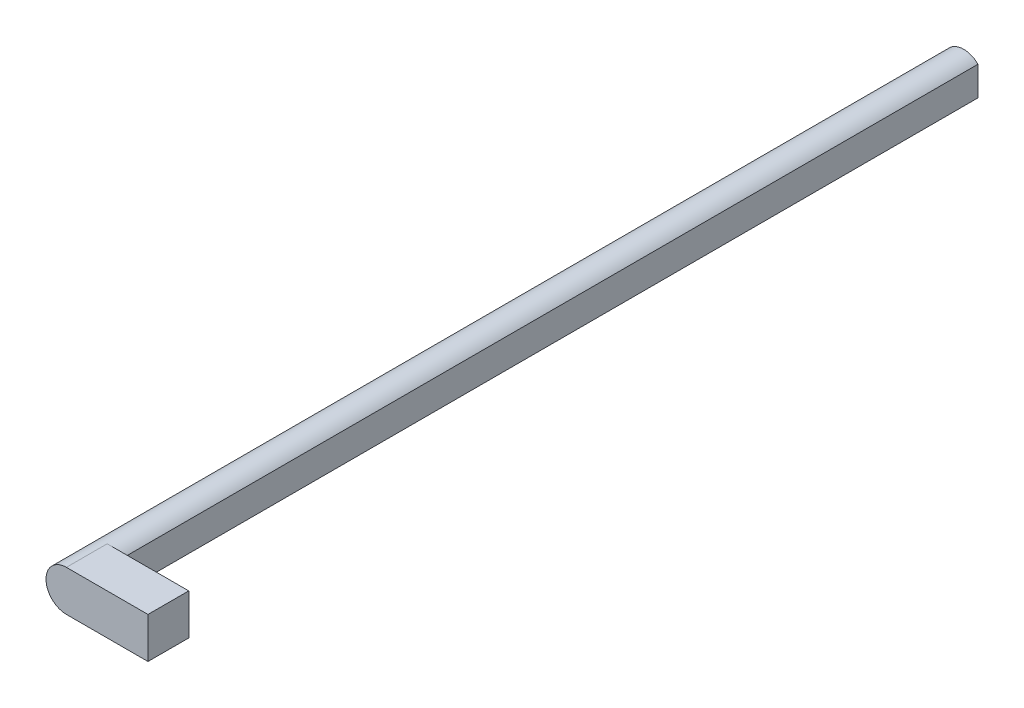
ISO-10303-21;
HEADER;
FILE_DESCRIPTION(('STEP AP214'),'2;1');
FILE_NAME('part.step','',(''),(''),'','','');
FILE_SCHEMA(('AUTOMOTIVE_DESIGN { 1 0 10303 214 1 1 1 1 }'));
ENDSEC;
DATA;
#1=APPLICATION_CONTEXT('core data for automotive mechanical design processes');
#2=APPLICATION_PROTOCOL_DEFINITION('international standard','automotive_design',2000,#1);
#3=PRODUCT_CONTEXT('',#1,'mechanical');
#4=PRODUCT('Part','Part','',(#3));
#5=PRODUCT_RELATED_PRODUCT_CATEGORY('part','',(#4));
#6=PRODUCT_DEFINITION_FORMATION('','',#4);
#7=PRODUCT_DEFINITION_CONTEXT('part definition',#1,'design');
#8=PRODUCT_DEFINITION('design','',#6,#7);
#9=PRODUCT_DEFINITION_SHAPE('','',#8);
#10=(LENGTH_UNIT() NAMED_UNIT(*) SI_UNIT(.MILLI.,.METRE.));
#11=(NAMED_UNIT(*) PLANE_ANGLE_UNIT() SI_UNIT($,.RADIAN.));
#12=(NAMED_UNIT(*) SI_UNIT($,.STERADIAN.) SOLID_ANGLE_UNIT());
#13=UNCERTAINTY_MEASURE_WITH_UNIT(LENGTH_MEASURE(1.E-05),#10,'distance_accuracy_value','');
#14=(GEOMETRIC_REPRESENTATION_CONTEXT(3) GLOBAL_UNCERTAINTY_ASSIGNED_CONTEXT((#13)) GLOBAL_UNIT_ASSIGNED_CONTEXT((#10,
#11,#12)) REPRESENTATION_CONTEXT('',''));
#15=CARTESIAN_POINT('',(0.,0.,0.));
#16=DIRECTION('',(0.,0.,1.));
#17=DIRECTION('',(1.,0.,0.));
#18=AXIS2_PLACEMENT_3D('',#15,#16,#17);
#19=CARTESIAN_POINT('',(3.5,0.,220.));
#20=DIRECTION('',(-1.,0.,0.));
#21=DIRECTION('',(0.,0.,1.));
#22=AXIS2_PLACEMENT_3D('',#19,#20,#21);
#23=PLANE('',#22);
#24=DIRECTION('',(0.,1.,0.));
#25=VECTOR('',#24,1.);
#26=CARTESIAN_POINT('',(3.5,0.,210.));
#27=LINE('',#26,#25);
#28=CARTESIAN_POINT('',(3.5,-3.57071421427143,210.));
#29=VERTEX_POINT('',#28);
#30=CARTESIAN_POINT('',(3.5,3.57071421427143,210.));
#31=VERTEX_POINT('',#30);
#32=EDGE_CURVE('E112',#29,#31,#27,.T.);
#33=ORIENTED_EDGE('',*,*,#32,.F.);
#34=DIRECTION('',(0.,0.,-1.));
#35=VECTOR('',#34,1.);
#36=CARTESIAN_POINT('',(3.5,-3.57071421427143,220.));
#37=LINE('',#36,#35);
#38=CARTESIAN_POINT('',(3.5,-3.57071421427143,0.));
#39=VERTEX_POINT('',#38);
#40=EDGE_CURVE('E57',#29,#39,#37,.T.);
#41=ORIENTED_EDGE('',*,*,#40,.T.);
#42=DIRECTION('',(0.,1.,0.));
#43=VECTOR('',#42,1.);
#44=CARTESIAN_POINT('',(3.5,0.,0.));
#45=LINE('',#44,#43);
#46=CARTESIAN_POINT('',(3.5,3.57071421427143,0.));
#47=VERTEX_POINT('',#46);
#48=EDGE_CURVE('E114',#39,#47,#45,.T.);
#49=ORIENTED_EDGE('',*,*,#48,.T.);
#50=DIRECTION('',(0.,0.,-1.));
#51=VECTOR('',#50,1.);
#52=CARTESIAN_POINT('',(3.5,3.57071421427143,220.));
#53=LINE('',#52,#51);
#54=EDGE_CURVE('E125',#31,#47,#53,.T.);
#55=ORIENTED_EDGE('',*,*,#54,.F.);
#56=EDGE_LOOP('',(#33,#41,#49,#55));
#57=FACE_BOUND('',#56,.T.);
#58=ADVANCED_FACE('F35',(#57),#23,.F.);
#59=CARTESIAN_POINT('',(0.,0.,220.));
#60=DIRECTION('',(0.,0.,-1.));
#61=DIRECTION('',(-1.,0.,0.));
#62=AXIS2_PLACEMENT_3D('',#59,#60,#61);
#63=CYLINDRICAL_SURFACE('',#62,5.);
#64=CARTESIAN_POINT('',(0.,0.,210.));
#65=DIRECTION('',(0.,0.,1.));
#66=DIRECTION('',(1.,0.,0.));
#67=AXIS2_PLACEMENT_3D('',#64,#65,#66);
#68=CIRCLE('',#67,5.);
#69=CARTESIAN_POINT('',(0.,5.,210.));
#70=VERTEX_POINT('',#69);
#71=EDGE_CURVE('E11',#31,#70,#68,.T.);
#72=ORIENTED_EDGE('',*,*,#71,.F.);
#73=ORIENTED_EDGE('',*,*,#54,.T.);
#74=CARTESIAN_POINT('',(0.,0.,0.));
#75=DIRECTION('',(0.,0.,1.));
#76=DIRECTION('',(1.,0.,0.));
#77=AXIS2_PLACEMENT_3D('',#74,#75,#76);
#78=CIRCLE('',#77,5.);
#79=EDGE_CURVE('E122',#47,#39,#78,.T.);
#80=ORIENTED_EDGE('',*,*,#79,.T.);
#81=ORIENTED_EDGE('',*,*,#40,.F.);
#82=CARTESIAN_POINT('',(0.,-5.,210.));
#83=VERTEX_POINT('',#82);
#84=EDGE_CURVE('E38',#83,#29,#68,.T.);
#85=ORIENTED_EDGE('',*,*,#84,.F.);
#86=DIRECTION('',(0.,0.,-1.));
#87=VECTOR('',#86,1.);
#88=CARTESIAN_POINT('',(0.,-5.,220.));
#89=LINE('',#88,#87);
#90=CARTESIAN_POINT('',(0.,-5.,220.));
#91=VERTEX_POINT('',#90);
#92=EDGE_CURVE('E108',#91,#83,#89,.T.);
#93=ORIENTED_EDGE('',*,*,#92,.F.);
#94=CARTESIAN_POINT('',(0.,0.,220.));
#95=DIRECTION('',(0.,0.,1.));
#96=DIRECTION('',(1.,0.,0.));
#97=AXIS2_PLACEMENT_3D('',#94,#95,#96);
#98=CIRCLE('',#97,5.);
#99=CARTESIAN_POINT('',(0.,5.,220.));
#100=VERTEX_POINT('',#99);
#101=EDGE_CURVE('E119',#100,#91,#98,.T.);
#102=ORIENTED_EDGE('',*,*,#101,.F.);
#103=DIRECTION('',(0.,0.,1.));
#104=VECTOR('',#103,1.);
#105=CARTESIAN_POINT('',(0.,5.,220.));
#106=LINE('',#105,#104);
#107=EDGE_CURVE('E193',#70,#100,#106,.T.);
#108=ORIENTED_EDGE('',*,*,#107,.F.);
#109=EDGE_LOOP('',(#72,#73,#80,#81,#85,#93,#102,#108));
#110=FACE_BOUND('',#109,.T.);
#111=ADVANCED_FACE('F131',(#110),#63,.T.);
#112=CARTESIAN_POINT('',(0.,0.,220.));
#113=DIRECTION('',(0.,0.,1.));
#114=DIRECTION('',(1.,0.,0.));
#115=AXIS2_PLACEMENT_3D('',#112,#113,#114);
#116=PLANE('',#115);
#117=DIRECTION('',(-1.,0.,0.));
#118=VECTOR('',#117,1.);
#119=CARTESIAN_POINT('',(20.,5.,220.));
#120=LINE('',#119,#118);
#121=CARTESIAN_POINT('',(20.,5.,220.));
#122=VERTEX_POINT('',#121);
#123=EDGE_CURVE('E96',#122,#100,#120,.T.);
#124=ORIENTED_EDGE('',*,*,#123,.T.);
#125=ORIENTED_EDGE('',*,*,#101,.T.);
#126=DIRECTION('',(-1.,0.,0.));
#127=VECTOR('',#126,1.);
#128=CARTESIAN_POINT('',(20.,-5.,220.));
#129=LINE('',#128,#127);
#130=CARTESIAN_POINT('',(20.,-5.,220.));
#131=VERTEX_POINT('',#130);
#132=EDGE_CURVE('E49',#131,#91,#129,.T.);
#133=ORIENTED_EDGE('',*,*,#132,.F.);
#134=DIRECTION('',(0.,-1.,0.));
#135=VECTOR('',#134,1.);
#136=CARTESIAN_POINT('',(20.,-5.,220.));
#137=LINE('',#136,#135);
#138=EDGE_CURVE('E99',#122,#131,#137,.T.);
#139=ORIENTED_EDGE('',*,*,#138,.F.);
#140=EDGE_LOOP('',(#124,#125,#133,#139));
#141=FACE_BOUND('',#140,.T.);
#142=ADVANCED_FACE('F136',(#141),#116,.T.);
#143=CARTESIAN_POINT('',(0.,0.,0.));
#144=DIRECTION('',(0.,0.,1.));
#145=DIRECTION('',(1.,0.,0.));
#146=AXIS2_PLACEMENT_3D('',#143,#144,#145);
#147=PLANE('',#146);
#148=ORIENTED_EDGE('',*,*,#48,.F.);
#149=ORIENTED_EDGE('',*,*,#79,.F.);
#150=EDGE_LOOP('',(#148,#149));
#151=FACE_BOUND('',#150,.T.);
#152=ADVANCED_FACE('F134',(#151),#147,.F.);
#153=CARTESIAN_POINT('',(20.,-5.,210.));
#154=DIRECTION('',(0.,0.,1.));
#155=DIRECTION('',(1.,0.,0.));
#156=AXIS2_PLACEMENT_3D('',#153,#154,#155);
#157=PLANE('',#156);
#158=DIRECTION('',(-1.,0.,0.));
#159=VECTOR('',#158,1.);
#160=CARTESIAN_POINT('',(20.,-5.,210.));
#161=LINE('',#160,#159);
#162=CARTESIAN_POINT('',(20.,-5.,210.));
#163=VERTEX_POINT('',#162);
#164=EDGE_CURVE('E130',#163,#83,#161,.T.);
#165=ORIENTED_EDGE('',*,*,#164,.T.);
#166=ORIENTED_EDGE('',*,*,#84,.T.);
#167=ORIENTED_EDGE('',*,*,#32,.T.);
#168=ORIENTED_EDGE('',*,*,#71,.T.);
#169=DIRECTION('',(-1.,0.,0.));
#170=VECTOR('',#169,1.);
#171=CARTESIAN_POINT('',(20.,5.,210.));
#172=LINE('',#171,#170);
#173=CARTESIAN_POINT('',(20.,5.,210.));
#174=VERTEX_POINT('',#173);
#175=EDGE_CURVE('E93',#174,#70,#172,.T.);
#176=ORIENTED_EDGE('',*,*,#175,.F.);
#177=DIRECTION('',(0.,1.,0.));
#178=VECTOR('',#177,1.);
#179=CARTESIAN_POINT('',(20.,-5.,210.));
#180=LINE('',#179,#178);
#181=EDGE_CURVE('E100',#163,#174,#180,.T.);
#182=ORIENTED_EDGE('',*,*,#181,.F.);
#183=EDGE_LOOP('',(#165,#166,#167,#168,#176,#182));
#184=FACE_BOUND('',#183,.T.);
#185=ADVANCED_FACE('F110',(#184),#157,.F.);
#186=CARTESIAN_POINT('',(20.,5.,220.));
#187=DIRECTION('',(0.,-1.,0.));
#188=DIRECTION('',(0.,0.,-1.));
#189=AXIS2_PLACEMENT_3D('',#186,#187,#188);
#190=PLANE('',#189);
#191=ORIENTED_EDGE('',*,*,#107,.T.);
#192=ORIENTED_EDGE('',*,*,#123,.F.);
#193=DIRECTION('',(0.,0.,1.));
#194=VECTOR('',#193,1.);
#195=CARTESIAN_POINT('',(20.,5.,220.));
#196=LINE('',#195,#194);
#197=EDGE_CURVE('E89',#174,#122,#196,.T.);
#198=ORIENTED_EDGE('',*,*,#197,.F.);
#199=ORIENTED_EDGE('',*,*,#175,.T.);
#200=EDGE_LOOP('',(#191,#192,#198,#199));
#201=FACE_BOUND('',#200,.T.);
#202=ADVANCED_FACE('F91',(#201),#190,.F.);
#203=CARTESIAN_POINT('',(20.,-5.,220.));
#204=DIRECTION('',(0.,1.,0.));
#205=DIRECTION('',(0.,0.,1.));
#206=AXIS2_PLACEMENT_3D('',#203,#204,#205);
#207=PLANE('',#206);
#208=ORIENTED_EDGE('',*,*,#92,.T.);
#209=ORIENTED_EDGE('',*,*,#164,.F.);
#210=DIRECTION('',(0.,0.,-1.));
#211=VECTOR('',#210,1.);
#212=CARTESIAN_POINT('',(20.,-5.,220.));
#213=LINE('',#212,#211);
#214=EDGE_CURVE('E104',#131,#163,#213,.T.);
#215=ORIENTED_EDGE('',*,*,#214,.F.);
#216=ORIENTED_EDGE('',*,*,#132,.T.);
#217=EDGE_LOOP('',(#208,#209,#215,#216));
#218=FACE_BOUND('',#217,.T.);
#219=ADVANCED_FACE('F172',(#218),#207,.F.);
#220=CARTESIAN_POINT('',(20.,0.,0.));
#221=DIRECTION('',(-1.,0.,0.));
#222=DIRECTION('',(0.,0.,1.));
#223=AXIS2_PLACEMENT_3D('',#220,#221,#222);
#224=PLANE('',#223);
#225=ORIENTED_EDGE('',*,*,#181,.T.);
#226=ORIENTED_EDGE('',*,*,#197,.T.);
#227=ORIENTED_EDGE('',*,*,#138,.T.);
#228=ORIENTED_EDGE('',*,*,#214,.T.);
#229=EDGE_LOOP('',(#225,#226,#227,#228));
#230=FACE_BOUND('',#229,.T.);
#231=ADVANCED_FACE('F103',(#230),#224,.F.);
#232=CLOSED_SHELL('',(#58,#111,#142,#152,#185,#202,#219,#231));
#233=MANIFOLD_SOLID_BREP('B2',#232);
#234=ADVANCED_BREP_SHAPE_REPRESENTATION('',(#18,#233),#14);
#235=SHAPE_DEFINITION_REPRESENTATION(#9,#234);
ENDSEC;
END-ISO-10303-21;
